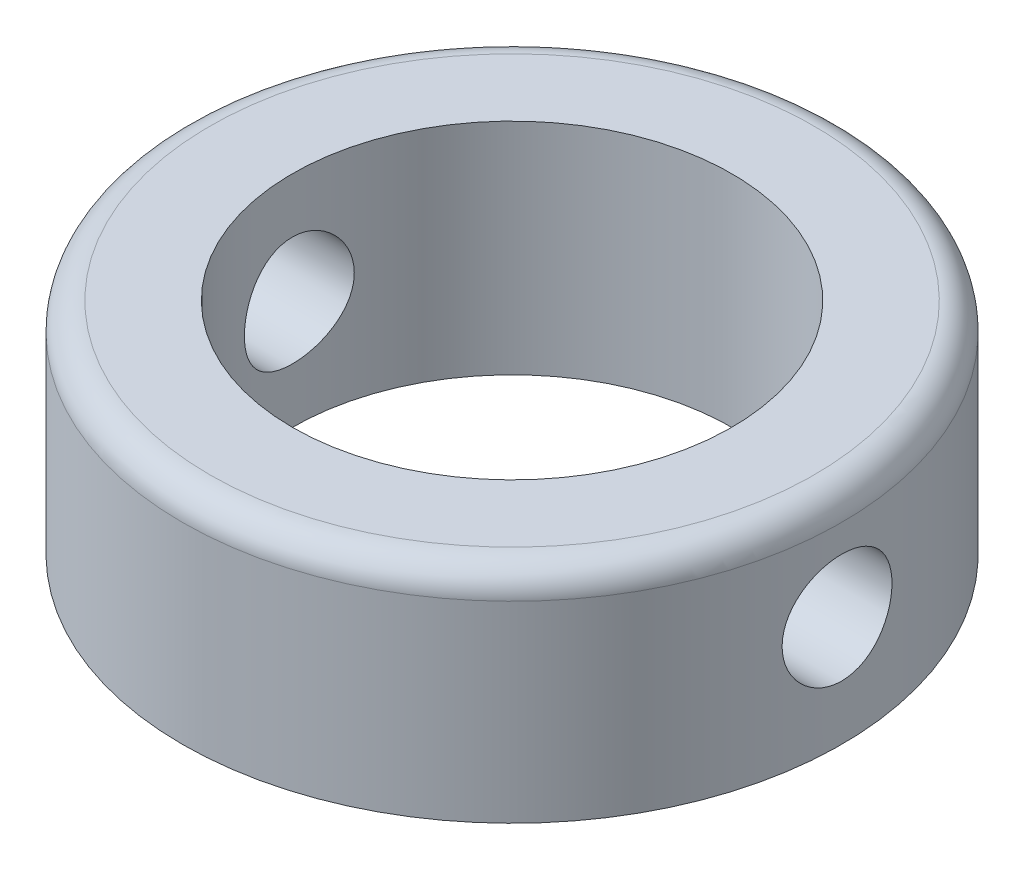
ISO-10303-21;
HEADER;
FILE_DESCRIPTION(('STEP AP214'),'2;1');
FILE_NAME('part.step','',(''),(''),'','','');
FILE_SCHEMA(('AUTOMOTIVE_DESIGN { 1 0 10303 214 1 1 1 1 }'));
ENDSEC;
DATA;
#1=APPLICATION_CONTEXT('core data for automotive mechanical design processes');
#2=APPLICATION_PROTOCOL_DEFINITION('international standard','automotive_design',2000,#1);
#3=PRODUCT_CONTEXT('',#1,'mechanical');
#4=PRODUCT('Part','Part','',(#3));
#5=PRODUCT_RELATED_PRODUCT_CATEGORY('part','',(#4));
#6=PRODUCT_DEFINITION_FORMATION('','',#4);
#7=PRODUCT_DEFINITION_CONTEXT('part definition',#1,'design');
#8=PRODUCT_DEFINITION('design','',#6,#7);
#9=PRODUCT_DEFINITION_SHAPE('','',#8);
#10=(LENGTH_UNIT() NAMED_UNIT(*) SI_UNIT(.MILLI.,.METRE.));
#11=(NAMED_UNIT(*) PLANE_ANGLE_UNIT() SI_UNIT($,.RADIAN.));
#12=(NAMED_UNIT(*) SI_UNIT($,.STERADIAN.) SOLID_ANGLE_UNIT());
#13=UNCERTAINTY_MEASURE_WITH_UNIT(LENGTH_MEASURE(1.E-05),#10,'distance_accuracy_value','');
#14=(GEOMETRIC_REPRESENTATION_CONTEXT(3) GLOBAL_UNCERTAINTY_ASSIGNED_CONTEXT((#13)) GLOBAL_UNIT_ASSIGNED_CONTEXT((#10,
#11,#12)) REPRESENTATION_CONTEXT('',''));
#15=CARTESIAN_POINT('',(0.,0.,0.));
#16=DIRECTION('',(0.,0.,1.));
#17=DIRECTION('',(1.,0.,0.));
#18=AXIS2_PLACEMENT_3D('',#15,#16,#17);
#19=CARTESIAN_POINT('',(0.,8.,0.));
#20=DIRECTION('',(0.,1.,0.));
#21=DIRECTION('',(0.,0.,1.));
#22=AXIS2_PLACEMENT_3D('',#19,#20,#21);
#23=PLANE('',#22);
#24=CARTESIAN_POINT('',(0.,8.,0.));
#25=DIRECTION('',(0.,1.,0.));
#26=DIRECTION('',(0.,0.,1.));
#27=AXIS2_PLACEMENT_3D('',#24,#25,#26);
#28=CIRCLE('',#27,11.);
#29=CARTESIAN_POINT('',(0.,8.,11.));
#30=VERTEX_POINT('',#29);
#31=EDGE_CURVE('E43',#30,#30,#28,.T.);
#32=ORIENTED_EDGE('',*,*,#31,.T.);
#33=EDGE_LOOP('',(#32));
#34=FACE_BOUND('',#33,.T.);
#35=CARTESIAN_POINT('',(0.,8.,0.));
#36=DIRECTION('',(0.,1.,0.));
#37=DIRECTION('',(0.,0.,1.));
#38=AXIS2_PLACEMENT_3D('',#35,#36,#37);
#39=CIRCLE('',#38,8.);
#40=CARTESIAN_POINT('',(0.,8.,8.));
#41=VERTEX_POINT('',#40);
#42=EDGE_CURVE('E93',#41,#41,#39,.T.);
#43=ORIENTED_EDGE('',*,*,#42,.F.);
#44=EDGE_LOOP('',(#43));
#45=FACE_BOUND('',#44,.T.);
#46=ADVANCED_FACE('F31',(#34,#45),#23,.T.);
#47=CARTESIAN_POINT('',(0.,0.,0.));
#48=DIRECTION('',(0.,1.,0.));
#49=DIRECTION('',(0.,0.,1.));
#50=AXIS2_PLACEMENT_3D('',#47,#48,#49);
#51=PLANE('',#50);
#52=CARTESIAN_POINT('',(0.,0.,0.));
#53=DIRECTION('',(0.,1.,0.));
#54=DIRECTION('',(0.,0.,1.));
#55=AXIS2_PLACEMENT_3D('',#52,#53,#54);
#56=CIRCLE('',#55,12.);
#57=CARTESIAN_POINT('',(0.,0.,12.));
#58=VERTEX_POINT('',#57);
#59=EDGE_CURVE('E48',#58,#58,#56,.T.);
#60=ORIENTED_EDGE('',*,*,#59,.F.);
#61=EDGE_LOOP('',(#60));
#62=FACE_BOUND('',#61,.T.);
#63=CARTESIAN_POINT('',(0.,0.,0.));
#64=DIRECTION('',(0.,1.,0.));
#65=DIRECTION('',(0.,0.,1.));
#66=AXIS2_PLACEMENT_3D('',#63,#64,#65);
#67=CIRCLE('',#66,8.);
#68=CARTESIAN_POINT('',(0.,0.,8.));
#69=VERTEX_POINT('',#68);
#70=EDGE_CURVE('E95',#69,#69,#67,.T.);
#71=ORIENTED_EDGE('',*,*,#70,.T.);
#72=EDGE_LOOP('',(#71));
#73=FACE_BOUND('',#72,.T.);
#74=ADVANCED_FACE('F80',(#62,#73),#51,.F.);
#75=CARTESIAN_POINT('',(0.,8.,0.));
#76=DIRECTION('',(0.,-1.,0.));
#77=DIRECTION('',(0.,0.,-1.));
#78=AXIS2_PLACEMENT_3D('',#75,#76,#77);
#79=CYLINDRICAL_SURFACE('',#78,12.);
#80=CARTESIAN_POINT('',(-11.8321595661992,4.,-2.));
#81=CARTESIAN_POINT('',(-11.8321615789328,4.11150059852945,-1.99999551873586));
#82=CARTESIAN_POINT('',(-11.8337527390819,4.22306208485718,-1.99064413522262));
#83=CARTESIAN_POINT('',(-11.8399396576003,4.44305483461054,-1.9535019424531));
#84=CARTESIAN_POINT('',(-11.844538186771,4.55148311500645,-1.92569412824689));
#85=CARTESIAN_POINT('',(-11.8562048749385,4.76199382667329,-1.8525036349364));
#86=CARTESIAN_POINT('',(-11.8632709694721,4.8640814789298,-1.80713564394559));
#87=CARTESIAN_POINT('',(-11.8790741768183,5.05918476377422,-1.70014919751157));
#88=CARTESIAN_POINT('',(-11.8878111015538,5.15220141566187,-1.63853257080106));
#89=CARTESIAN_POINT('',(-11.906067769247,5.32745027979565,-1.50015002157323));
#90=CARTESIAN_POINT('',(-11.9155937386236,5.40958010510897,-1.42325523914587));
#91=CARTESIAN_POINT('',(-11.9342998453486,5.55983464548945,-1.25677760375622));
#92=CARTESIAN_POINT('',(-11.9434799621739,5.62795853049233,-1.16719399931998));
#93=CARTESIAN_POINT('',(-11.9605258958617,5.74865165377542,-0.977218295958684));
#94=CARTESIAN_POINT('',(-11.9683835394587,5.80112560618544,-0.876764865165366));
#95=CARTESIAN_POINT('',(-11.9818298956567,5.88841685642444,-0.668316497379094));
#96=CARTESIAN_POINT('',(-11.9874187557813,5.9232353023079,-0.56032205126255));
#97=CARTESIAN_POINT('',(-11.9956538777952,5.97391402798712,-0.340914981075393));
#98=CARTESIAN_POINT('',(-11.9983268248873,5.98994633280375,-0.229543109343416));
#99=CARTESIAN_POINT('',(-12.0005206347422,6.00313260332208,-0.00566022842063707));
#100=CARTESIAN_POINT('',(-12.0000417117545,6.00028785219779,0.106850702823119));
#101=CARTESIAN_POINT('',(-11.9960068674511,5.97593491877743,0.328641748063101));
#102=CARTESIAN_POINT('',(-11.9924814695392,5.95461186927268,0.437942824560113));
#103=CARTESIAN_POINT('',(-11.9827838301731,5.89419914060281,0.651393583689433));
#104=CARTESIAN_POINT('',(-11.9766115081057,5.8551089203284,0.755543109321203));
#105=CARTESIAN_POINT('',(-11.9622615880957,5.76008748774775,0.956284918226118));
#106=CARTESIAN_POINT('',(-11.954074938615,5.70407999033405,1.05284041841524));
#107=CARTESIAN_POINT('',(-11.936605904572,5.57686974189196,1.23525242387731));
#108=CARTESIAN_POINT('',(-11.9273234313531,5.50566576103135,1.3211080623327));
#109=CARTESIAN_POINT('',(-11.9085621458608,5.34905695470455,1.48077701875733));
#110=CARTESIAN_POINT('',(-11.8990823178483,5.26349032407921,1.55443160180257));
#111=CARTESIAN_POINT('',(-11.8811036782784,5.08113032782734,1.68636367075845));
#112=CARTESIAN_POINT('',(-11.8726048757706,4.98433685865374,1.74464101482593));
#113=CARTESIAN_POINT('',(-11.8575500364945,4.78208668649802,1.84419554759063));
#114=CARTESIAN_POINT('',(-11.8509961864208,4.67662040152633,1.88545362182339));
#115=CARTESIAN_POINT('',(-11.840609509519,4.46012074215396,1.94962389665249));
#116=CARTESIAN_POINT('',(-11.8367764431066,4.34908785885406,1.97253771261436));
#117=CARTESIAN_POINT('',(-11.8323116753769,4.1260270750703,1.99914550790341));
#118=CARTESIAN_POINT('',(-11.8316422860693,4.01402689623832,2.00306576632995));
#119=CARTESIAN_POINT('',(-11.8334802782589,3.79097066264734,1.99217816214597));
#120=CARTESIAN_POINT('',(-11.8359875370548,3.67991457158882,1.97737102289973));
#121=CARTESIAN_POINT('',(-11.8438614996401,3.46261779264731,1.92964186794248));
#122=CARTESIAN_POINT('',(-11.8492100153468,3.35635108809759,1.89683503251711));
#123=CARTESIAN_POINT('',(-11.862148584044,3.15082386697641,1.81415855215382));
#124=CARTESIAN_POINT('',(-11.8697387711246,3.05156376995928,1.76428788648075));
#125=CARTESIAN_POINT('',(-11.8863930271791,2.86186032447511,1.64836533858338));
#126=CARTESIAN_POINT('',(-11.8954700448028,2.77150674179515,1.58216845132749));
#127=CARTESIAN_POINT('',(-11.9140373334389,2.603109173844,1.43567157256638));
#128=CARTESIAN_POINT('',(-11.9235276334826,2.52506605511221,1.35537058910724));
#129=CARTESIAN_POINT('',(-11.9419713769461,2.38267848581704,1.18194245626305));
#130=CARTESIAN_POINT('',(-11.9509182107574,2.31848493897237,1.08869060270896));
#131=CARTESIAN_POINT('',(-11.9671608994635,2.2066757383961,0.892594758359461));
#132=CARTESIAN_POINT('',(-11.9744568077598,2.15905954842092,0.789751077976501));
#133=CARTESIAN_POINT('',(-11.9865468653567,2.08199153283611,0.577839241201062));
#134=CARTESIAN_POINT('',(-11.9913518765409,2.05246073941206,0.468800450082089));
#135=CARTESIAN_POINT('',(-11.9979646653543,2.01214752082894,0.247224587899369));
#136=CARTESIAN_POINT('',(-11.9997726896015,2.00136355301412,0.134687805457296));
#137=CARTESIAN_POINT('',(-12.0001843031025,1.99889449415024,-0.0892330206189419));
#138=CARTESIAN_POINT('',(-11.9988264161935,2.00697979684713,-0.200614528482133));
#139=CARTESIAN_POINT('',(-11.9931374270986,2.04152313781554,-0.420409579451765));
#140=CARTESIAN_POINT('',(-11.9888063415615,2.06798107320774,-0.528823139173984));
#141=CARTESIAN_POINT('',(-11.9776559106192,2.13843053243492,-0.739517156734829));
#142=CARTESIAN_POINT('',(-11.970839336327,2.18240253456804,-0.841804297723055));
#143=CARTESIAN_POINT('',(-11.9554620550242,2.28660634898446,-1.03758436238573));
#144=CARTESIAN_POINT('',(-11.9469012653393,2.34683893204996,-1.13107686889458));
#145=CARTESIAN_POINT('',(-11.9288610369313,2.4826680739684,-1.30777035642112));
#146=CARTESIAN_POINT('',(-11.919372196329,2.558432763801,-1.3908411444822));
#147=CARTESIAN_POINT('',(-11.9006104265149,2.72282264632305,-1.54317110076073));
#148=CARTESIAN_POINT('',(-11.8913375483961,2.81145084713002,-1.61242702936952));
#149=CARTESIAN_POINT('',(-11.8739867482713,2.99979625799169,-1.73561141672869));
#150=CARTESIAN_POINT('',(-11.8659177427663,3.09958747181239,-1.78942799124616));
#151=CARTESIAN_POINT('',(-11.8519936807305,3.30688738867052,-1.87945162912342));
#152=CARTESIAN_POINT('',(-11.846136413799,3.41438825814189,-1.91567628417846));
#153=CARTESIAN_POINT('',(-11.8385979588519,3.60192301558991,-1.96162084250194));
#154=CARTESIAN_POINT('',(-11.8361969873557,3.68082144637008,-1.97598993413711));
#155=CARTESIAN_POINT('',(-11.8329770823046,3.83980278786955,-1.99518103614505));
#156=CARTESIAN_POINT('',(-11.8321581200295,3.91988567705936,-2.00000321983422));
#157=CARTESIAN_POINT('',(-11.8321595661992,4.,-2.));
#158=B_SPLINE_CURVE_WITH_KNOTS('',3,(#80,#81,#82,#83,#84,#85,#86,#87,#88,#89,#90,#91,#92,#93,
#94,#95,#96,#97,#98,#99,#100,#101,#102,#103,#104,#105,#106,#107,#108,#109,#110,#111,#112,#113,
#114,#115,#116,#117,#118,#119,#120,#121,#122,#123,#124,#125,#126,#127,#128,#129,#130,#131,#132,
#133,#134,#135,#136,#137,#138,#139,#140,#141,#142,#143,#144,#145,#146,#147,#148,#149,#150,#151,
#152,#153,#154,#155,#156,#157),.UNSPECIFIED.,.T.,.F.,(4,2,2,2,2,2,2,2,2,2,2,2,2,2,2,2,2,2,2,2,2,
2,2,2,2,2,2,2,2,2,2,2,2,2,2,2,2,2,4),(0.,0.334208831142192,0.668726015970376,1.00296399830015,
1.33716437924219,1.67431327324572,2.01148214267558,2.35066384089148,2.6898234808889,
3.02585253978052,3.36185875722154,3.69453696931735,4.02722531399626,4.3614368331154,
4.69567540981411,5.03396898769699,5.37226568596815,5.71094129998883,6.04958708750462,
6.38418833936328,6.71877666731181,7.05124851708393,7.38374025834859,7.71929874210161,
8.05488083544551,8.39395290428305,8.73301400381358,9.07058387534117,9.40812596729881,
9.74158221012733,10.0750365857506,10.4081203186597,10.7412198431387,11.078135979706,
11.4151310310545,11.7545098209466,12.0935485339556,12.3336853643501,12.5738178352145),.UNSPECIFIED.);
#159=CARTESIAN_POINT('',(-11.8321595661992,4.,-2.));
#160=VERTEX_POINT('',#159);
#161=EDGE_CURVE('E72',#160,#160,#158,.T.);
#162=ORIENTED_EDGE('',*,*,#161,.T.);
#163=EDGE_LOOP('',(#162));
#164=FACE_BOUND('',#163,.T.);
#165=CARTESIAN_POINT('',(11.8321595661992,4.,-2.));
#166=CARTESIAN_POINT('',(11.8321615789328,3.88849940147055,-1.99999551873586));
#167=CARTESIAN_POINT('',(11.8337527390819,3.77693791514282,-1.99064413522263));
#168=CARTESIAN_POINT('',(11.8399396576003,3.55694516538947,-1.9535019424531));
#169=CARTESIAN_POINT('',(11.844538186771,3.44851688499355,-1.92569412824689));
#170=CARTESIAN_POINT('',(11.8562048749385,3.23800617332672,-1.8525036349364));
#171=CARTESIAN_POINT('',(11.8632709694721,3.1359185210702,-1.80713564394559));
#172=CARTESIAN_POINT('',(11.8790741768183,2.94081523622578,-1.70014919751157));
#173=CARTESIAN_POINT('',(11.8878111015538,2.84779858433814,-1.63853257080106));
#174=CARTESIAN_POINT('',(11.906067769247,2.67254972020435,-1.50015002157323));
#175=CARTESIAN_POINT('',(11.9155937386236,2.59041989489103,-1.42325523914587));
#176=CARTESIAN_POINT('',(11.9342998453486,2.44016535451055,-1.25677760375622));
#177=CARTESIAN_POINT('',(11.9434799621739,2.37204146950767,-1.16719399931998));
#178=CARTESIAN_POINT('',(11.9605258958617,2.25134834622458,-0.977218295958686));
#179=CARTESIAN_POINT('',(11.9683835394587,2.19887439381456,-0.876764865165368));
#180=CARTESIAN_POINT('',(11.9818298956567,2.11158314357556,-0.668316497379096));
#181=CARTESIAN_POINT('',(11.9874187557813,2.0767646976921,-0.560322051262552));
#182=CARTESIAN_POINT('',(11.9956538777952,2.02608597201288,-0.340914981075395));
#183=CARTESIAN_POINT('',(11.9983268248873,2.01005366719625,-0.229543109343418));
#184=CARTESIAN_POINT('',(12.0005206347422,1.99686739667792,-0.00566022842063849));
#185=CARTESIAN_POINT('',(12.0000417117545,1.99971214780221,0.106850702823118));
#186=CARTESIAN_POINT('',(11.9960068674511,2.02406508122257,0.3286417480631));
#187=CARTESIAN_POINT('',(11.9924814695392,2.04538813072732,0.437942824560112));
#188=CARTESIAN_POINT('',(11.9827838301731,2.10580085939719,0.651393583689433));
#189=CARTESIAN_POINT('',(11.9766115081057,2.1448910796716,0.755543109321203));
#190=CARTESIAN_POINT('',(11.9622615880957,2.23991251225226,0.956284918226118));
#191=CARTESIAN_POINT('',(11.954074938615,2.29592000966595,1.05284041841524));
#192=CARTESIAN_POINT('',(11.936605904572,2.42313025810804,1.23525242387731));
#193=CARTESIAN_POINT('',(11.9273234313531,2.49433423896865,1.3211080623327));
#194=CARTESIAN_POINT('',(11.9085621458608,2.65094304529545,1.48077701875733));
#195=CARTESIAN_POINT('',(11.8990823178483,2.73650967592079,1.55443160180257));
#196=CARTESIAN_POINT('',(11.8811036782784,2.91886967217266,1.68636367075845));
#197=CARTESIAN_POINT('',(11.8726048757706,3.01566314134626,1.74464101482593));
#198=CARTESIAN_POINT('',(11.8575500364945,3.21791331350198,1.84419554759063));
#199=CARTESIAN_POINT('',(11.8509961864208,3.32337959847367,1.88545362182339));
#200=CARTESIAN_POINT('',(11.840609509519,3.53987925784604,1.94962389665249));
#201=CARTESIAN_POINT('',(11.8367764431066,3.65091214114594,1.97253771261436));
#202=CARTESIAN_POINT('',(11.8323116753769,3.87397292492971,1.99914550790341));
#203=CARTESIAN_POINT('',(11.8316422860693,3.98597310376168,2.00306576632995));
#204=CARTESIAN_POINT('',(11.8334802782589,4.20902933735266,1.99217816214597));
#205=CARTESIAN_POINT('',(11.8359875370548,4.32008542841118,1.97737102289973));
#206=CARTESIAN_POINT('',(11.8438614996401,4.53738220735269,1.92964186794248));
#207=CARTESIAN_POINT('',(11.8492100153468,4.64364891190241,1.89683503251711));
#208=CARTESIAN_POINT('',(11.862148584044,4.84917613302359,1.81415855215382));
#209=CARTESIAN_POINT('',(11.8697387711246,4.94843623004072,1.76428788648075));
#210=CARTESIAN_POINT('',(11.8863930271791,5.13813967552489,1.64836533858338));
#211=CARTESIAN_POINT('',(11.8954700448028,5.22849325820485,1.58216845132749));
#212=CARTESIAN_POINT('',(11.9140373334389,5.396890826156,1.43567157256639));
#213=CARTESIAN_POINT('',(11.9235276334826,5.47493394488779,1.35537058910724));
#214=CARTESIAN_POINT('',(11.9419713769461,5.61732151418296,1.18194245626305));
#215=CARTESIAN_POINT('',(11.9509182107574,5.68151506102763,1.08869060270896));
#216=CARTESIAN_POINT('',(11.9671608994635,5.7933242616039,0.892594758359463));
#217=CARTESIAN_POINT('',(11.9744568077598,5.84094045157908,0.789751077976503));
#218=CARTESIAN_POINT('',(11.9865468653567,5.91800846716389,0.577839241201064));
#219=CARTESIAN_POINT('',(11.9913518765409,5.94753926058794,0.468800450082091));
#220=CARTESIAN_POINT('',(11.9979646653543,5.98785247917106,0.24722458789937));
#221=CARTESIAN_POINT('',(11.9997726896015,5.99863644698588,0.134687805457298));
#222=CARTESIAN_POINT('',(12.0001843031025,6.00110550584976,-0.0892330206189402));
#223=CARTESIAN_POINT('',(11.9988264161935,5.99302020315287,-0.200614528482131));
#224=CARTESIAN_POINT('',(11.9931374270986,5.95847686218446,-0.420409579451763));
#225=CARTESIAN_POINT('',(11.9888063415615,5.93201892679226,-0.528823139173983));
#226=CARTESIAN_POINT('',(11.9776559106192,5.86156946756508,-0.73951715673483));
#227=CARTESIAN_POINT('',(11.970839336327,5.81759746543196,-0.841804297723056));
#228=CARTESIAN_POINT('',(11.9554620550242,5.71339365101554,-1.03758436238573));
#229=CARTESIAN_POINT('',(11.9469012653393,5.65316106795004,-1.13107686889458));
#230=CARTESIAN_POINT('',(11.9288610369313,5.5173319260316,-1.30777035642112));
#231=CARTESIAN_POINT('',(11.919372196329,5.44156723619899,-1.3908411444822));
#232=CARTESIAN_POINT('',(11.9006104265149,5.27717735367695,-1.54317110076073));
#233=CARTESIAN_POINT('',(11.8913375483961,5.18854915286998,-1.61242702936952));
#234=CARTESIAN_POINT('',(11.8739867482713,5.00020374200831,-1.73561141672869));
#235=CARTESIAN_POINT('',(11.8659177427663,4.90041252818761,-1.78942799124616));
#236=CARTESIAN_POINT('',(11.8519936807305,4.69311261132948,-1.87945162912342));
#237=CARTESIAN_POINT('',(11.846136413799,4.58561174185811,-1.91567628417846));
#238=CARTESIAN_POINT('',(11.8385979588519,4.39807698441009,-1.96162084250194));
#239=CARTESIAN_POINT('',(11.8361969873557,4.31917855362991,-1.97598993413711));
#240=CARTESIAN_POINT('',(11.8329770823046,4.16019721213045,-1.99518103614505));
#241=CARTESIAN_POINT('',(11.8321581200295,4.08011432294064,-2.00000321983422));
#242=CARTESIAN_POINT('',(11.8321595661992,4.,-2.));
#243=B_SPLINE_CURVE_WITH_KNOTS('',3,(#165,#166,#167,#168,#169,#170,#171,#172,#173,#174,#175,
#176,#177,#178,#179,#180,#181,#182,#183,#184,#185,#186,#187,#188,#189,#190,#191,#192,#193,#194,
#195,#196,#197,#198,#199,#200,#201,#202,#203,#204,#205,#206,#207,#208,#209,#210,#211,#212,#213,
#214,#215,#216,#217,#218,#219,#220,#221,#222,#223,#224,#225,#226,#227,#228,#229,#230,#231,#232,
#233,#234,#235,#236,#237,#238,#239,#240,#241,#242),.UNSPECIFIED.,.T.,.F.,(4,2,2,2,2,2,2,2,2,2,2,
2,2,2,2,2,2,2,2,2,2,2,2,2,2,2,2,2,2,2,2,2,2,2,2,2,2,2,4),(0.,0.334208831142192,
0.668726015970375,1.00296399830015,1.33716437924219,1.67431327324572,2.01148214267557,
2.35066384089148,2.6898234808889,3.02585253978052,3.36185875722153,3.69453696931735,
4.02722531399626,4.3614368331154,4.69567540981411,5.03396898769699,5.37226568596815,
5.71094129998883,6.04958708750461,6.38418833936328,6.71877666731181,7.05124851708393,
7.38374025834859,7.71929874210161,8.05488083544551,8.39395290428305,8.73301400381358,
9.07058387534117,9.4081259672988,9.74158221012733,10.0750365857506,10.4081203186597,
10.7412198431387,11.078135979706,11.4151310310545,11.7545098209466,12.0935485339556,
12.3336853643501,12.5738178352145),.UNSPECIFIED.);
#244=CARTESIAN_POINT('',(11.8321595661992,4.,-2.));
#245=VERTEX_POINT('',#244);
#246=EDGE_CURVE('E68',#245,#245,#243,.T.);
#247=ORIENTED_EDGE('',*,*,#246,.T.);
#248=EDGE_LOOP('',(#247));
#249=FACE_BOUND('',#248,.T.);
#250=CARTESIAN_POINT('',(0.,7.,0.));
#251=DIRECTION('',(0.,1.,0.));
#252=DIRECTION('',(0.,0.,1.));
#253=AXIS2_PLACEMENT_3D('',#250,#251,#252);
#254=CIRCLE('',#253,12.);
#255=CARTESIAN_POINT('',(0.,7.,12.));
#256=VERTEX_POINT('',#255);
#257=EDGE_CURVE('E10',#256,#256,#254,.F.);
#258=ORIENTED_EDGE('',*,*,#257,.T.);
#259=EDGE_LOOP('',(#258));
#260=FACE_BOUND('',#259,.T.);
#261=ORIENTED_EDGE('',*,*,#59,.T.);
#262=EDGE_LOOP('',(#261));
#263=FACE_BOUND('',#262,.T.);
#264=ADVANCED_FACE('F76',(#164,#249,#260,#263),#79,.T.);
#265=CARTESIAN_POINT('',(0.,8.,0.));
#266=DIRECTION('',(0.,-1.,0.));
#267=DIRECTION('',(0.,0.,-1.));
#268=AXIS2_PLACEMENT_3D('',#265,#266,#267);
#269=CYLINDRICAL_SURFACE('',#268,8.);
#270=CARTESIAN_POINT('',(-7.74596669241483,4.,-2.));
#271=CARTESIAN_POINT('',(-7.74596880070288,4.11044060074126,-1.99999686287446));
#272=CARTESIAN_POINT('',(-7.74835444811678,4.22091591894282,-1.99082099639812));
#273=CARTESIAN_POINT('',(-7.75761489594051,4.43869406253881,-1.95441850037103));
#274=CARTESIAN_POINT('',(-7.76449230897304,4.54599500357455,-1.92718136539368));
#275=CARTESIAN_POINT('',(-7.7819097967692,4.75424283054975,-1.85559295970563));
#276=CARTESIAN_POINT('',(-7.79244514152366,4.85519772430856,-1.81126378228359));
#277=CARTESIAN_POINT('',(-7.81598553623007,5.0482486820319,-1.70681691300911));
#278=CARTESIAN_POINT('',(-7.82899069102791,5.14034436966417,-1.64669855084855));
#279=CARTESIAN_POINT('',(-7.856325730845,5.31508931620977,-1.51096674184951));
#280=CARTESIAN_POINT('',(-7.87067678098427,5.39751488028004,-1.43506951016324));
#281=CARTESIAN_POINT('',(-7.89890300412235,5.54860911548827,-1.27054565128053));
#282=CARTESIAN_POINT('',(-7.91277813253111,5.6172765004974,-1.18191783534424));
#283=CARTESIAN_POINT('',(-7.93872332416466,5.73982037410502,-0.992916160863163));
#284=CARTESIAN_POINT('',(-7.95076549920474,5.79347711052917,-0.892395660956096));
#285=CARTESIAN_POINT('',(-7.97144649540787,5.88304771532247,-0.683410547434209));
#286=CARTESIAN_POINT('',(-7.98008581867475,5.91896420153241,-0.574947108633552));
#287=CARTESIAN_POINT('',(-7.99283807078544,5.97131826766287,-0.355487007003329));
#288=CARTESIAN_POINT('',(-7.99703915075451,5.98813571546127,-0.24458617563918));
#289=CARTESIAN_POINT('',(-8.00074875285838,6.00300670342044,-0.0214630554102152));
#290=CARTESIAN_POINT('',(-8.00025796877363,6.00106301776768,0.090759035630455));
#291=CARTESIAN_POINT('',(-7.99470475962828,5.97874011979988,0.310704494344774));
#292=CARTESIAN_POINT('',(-7.98974401872699,5.95877093995692,0.418472431202134));
#293=CARTESIAN_POINT('',(-7.97592669219883,5.9016229839612,0.629076494827372));
#294=CARTESIAN_POINT('',(-7.96706989918753,5.86444329169807,0.731912358740875));
#295=CARTESIAN_POINT('',(-7.94630007760717,5.77359794345035,0.930813407003612));
#296=CARTESIAN_POINT('',(-7.93436015756043,5.7197863642706,1.02680901953301));
#297=CARTESIAN_POINT('',(-7.90871923047719,5.59731545670699,1.20855124468098));
#298=CARTESIAN_POINT('',(-7.89501791721992,5.52865354515151,1.29429607017101));
#299=CARTESIAN_POINT('',(-7.86690971015616,5.3762330064141,1.45554807016991));
#300=CARTESIAN_POINT('',(-7.85249375620734,5.29211608612178,1.5307153581504));
#301=CARTESIAN_POINT('',(-7.82492034813365,5.1123200211678,1.66595275192604));
#302=CARTESIAN_POINT('',(-7.81176295284776,5.0166403364072,1.72602215209203));
#303=CARTESIAN_POINT('',(-7.78816397465319,4.81576797268083,1.82957625804519));
#304=CARTESIAN_POINT('',(-7.77773586980577,4.71053141574945,1.87297913394098));
#305=CARTESIAN_POINT('',(-7.76094912111966,4.49393162553884,1.94137124127268));
#306=CARTESIAN_POINT('',(-7.75458960648175,4.38256970881349,1.96636441310582));
#307=CARTESIAN_POINT('',(-7.74684284831313,4.16003239878151,1.99666371093214));
#308=CARTESIAN_POINT('',(-7.74532871274919,4.0489297653363,2.0024723791357));
#309=CARTESIAN_POINT('',(-7.74709874784831,3.82734245073748,1.99561359241244));
#310=CARTESIAN_POINT('',(-7.75038247681013,3.71685771363901,1.98294783827904));
#311=CARTESIAN_POINT('',(-7.76125665563648,3.50150858803624,1.93994037115013));
#312=CARTESIAN_POINT('',(-7.768775761875,3.39658181874333,1.9098912546254));
#313=CARTESIAN_POINT('',(-7.7872057461677,3.19325483371866,1.8332944653365));
#314=CARTESIAN_POINT('',(-7.79811702598891,3.09485539275573,1.78674483817004));
#315=CARTESIAN_POINT('',(-7.8223690967461,2.90524697770612,1.67741653434925));
#316=CARTESIAN_POINT('',(-7.83575334885313,2.81421692796552,1.6143374030685));
#317=CARTESIAN_POINT('',(-7.86333666457373,2.64384930975892,1.47412058586891));
#318=CARTESIAN_POINT('',(-7.87753586182776,2.56451366667994,1.39698058961088));
#319=CARTESIAN_POINT('',(-7.90557922425285,2.41775116594324,1.22852544196945));
#320=CARTESIAN_POINT('',(-7.91940561649468,2.35067194996095,1.13690390506319));
#321=CARTESIAN_POINT('',(-7.94477773290987,2.23285130643901,0.943405365389351));
#322=CARTESIAN_POINT('',(-7.95632357603169,2.18210902671344,0.841528897915182));
#323=CARTESIAN_POINT('',(-7.9757609259065,2.09884317237765,0.631116403462182));
#324=CARTESIAN_POINT('',(-7.98367864017925,2.06618857249675,0.522634762055765));
#325=CARTESIAN_POINT('',(-7.99508234716634,2.01963173231327,0.301499520637615));
#326=CARTESIAN_POINT('',(-7.99856919514738,2.00572587300877,0.188846730082482));
#327=CARTESIAN_POINT('',(-8.00068338817612,1.99726482084892,-0.034167052886645));
#328=CARTESIAN_POINT('',(-7.99943957759977,2.00219658180918,-0.144507653932042));
#329=CARTESIAN_POINT('',(-7.99251792914887,2.0300956545887,-0.3627349928295));
#330=CARTESIAN_POINT('',(-7.98684022314338,2.05306243002634,-0.470621803561855));
#331=CARTESIAN_POINT('',(-7.97170865707778,2.11610443954172,-0.680342071289546));
#332=CARTESIAN_POINT('',(-7.96227529004785,2.15608690662876,-0.782204989161724));
#333=CARTESIAN_POINT('',(-7.94062577827316,2.25194115803914,-0.977834106083247));
#334=CARTESIAN_POINT('',(-7.92840928277515,2.30781494534097,-1.07159928253126));
#335=CARTESIAN_POINT('',(-7.90214499360574,2.43543046799226,-1.25080385684661));
#336=CARTESIAN_POINT('',(-7.88806033883329,2.50752028580766,-1.33598997659667));
#337=CARTESIAN_POINT('',(-7.85981298114379,2.66484570395469,-1.49323004054701));
#338=CARTESIAN_POINT('',(-7.84565025934604,2.75008463222232,-1.56528065015318));
#339=CARTESIAN_POINT('',(-7.81854951691005,2.93320282837892,-1.69552405294366));
#340=CARTESIAN_POINT('',(-7.80563927346578,3.03128824673051,-1.75343323883276));
#341=CARTESIAN_POINT('',(-7.78287910989656,3.23611097974964,-1.85185379317094));
#342=CARTESIAN_POINT('',(-7.77302696466427,3.34284193218769,-1.8923778195043));
#343=CARTESIAN_POINT('',(-7.75903817501475,3.54115402367032,-1.948845057142));
#344=CARTESIAN_POINT('',(-7.75417326006998,3.63178632877227,-1.96798634119376));
#345=CARTESIAN_POINT('',(-7.7476367716524,3.81493773799538,-1.99356458514354));
#346=CARTESIAN_POINT('',(-7.74596492578215,3.9074566804888,-2.0000026287435));
#347=CARTESIAN_POINT('',(-7.74596669241483,4.,-2.));
#348=B_SPLINE_CURVE_WITH_KNOTS('',3,(#270,#271,#272,#273,#274,#275,#276,#277,#278,#279,#280,
#281,#282,#283,#284,#285,#286,#287,#288,#289,#290,#291,#292,#293,#294,#295,#296,#297,#298,#299,
#300,#301,#302,#303,#304,#305,#306,#307,#308,#309,#310,#311,#312,#313,#314,#315,#316,#317,#318,
#319,#320,#321,#322,#323,#324,#325,#326,#327,#328,#329,#330,#331,#332,#333,#334,#335,#336,#337,
#338,#339,#340,#341,#342,#343,#344,#345,#346,#347),.UNSPECIFIED.,.T.,.F.,(4,2,2,2,2,2,2,2,2,2,2,
2,2,2,2,2,2,2,2,2,2,2,2,2,2,2,2,2,2,2,2,2,2,2,2,2,2,2,4),(0.,0.330981953388909,
0.662156593142933,0.992904581732815,1.32366661404383,1.66099163354381,1.99834817183893,
2.34041197118336,2.68242527877674,3.01751000796277,3.35254518932816,3.68014610151157,
4.00776445379829,4.33834299403555,4.6689790837513,5.00856373257529,5.34816424959841,
5.68941145606722,6.03058560103638,6.36274859809373,6.69488101747041,7.02157924007365,
7.34831617137134,7.68146276687326,8.01466415108036,8.35620264772255,8.69772332575642,
9.03673658245543,9.3756843912723,9.70546756901965,10.0352409390158,10.3632390124777,
10.6912784459046,11.0271767726566,11.3631602525241,11.7054118182895,12.0474137709606,
12.3247826174462,12.6021278008238),.UNSPECIFIED.);
#349=CARTESIAN_POINT('',(-7.74596669241483,4.,-2.));
#350=VERTEX_POINT('',#349);
#351=EDGE_CURVE('E35',#350,#350,#348,.T.);
#352=ORIENTED_EDGE('',*,*,#351,.F.);
#353=EDGE_LOOP('',(#352));
#354=FACE_BOUND('',#353,.T.);
#355=CARTESIAN_POINT('',(7.74596669241483,4.,-2.));
#356=CARTESIAN_POINT('',(7.74596880070288,3.88955939925874,-1.99999686287446));
#357=CARTESIAN_POINT('',(7.74835444811678,3.77908408105718,-1.99082099639812));
#358=CARTESIAN_POINT('',(7.75761489594051,3.56130593746119,-1.95441850037103));
#359=CARTESIAN_POINT('',(7.76449230897304,3.45400499642545,-1.92718136539368));
#360=CARTESIAN_POINT('',(7.7819097967692,3.24575716945026,-1.85559295970563));
#361=CARTESIAN_POINT('',(7.79244514152366,3.14480227569143,-1.81126378228359));
#362=CARTESIAN_POINT('',(7.81598553623007,2.9517513179681,-1.70681691300911));
#363=CARTESIAN_POINT('',(7.82899069102791,2.85965563033583,-1.64669855084855));
#364=CARTESIAN_POINT('',(7.856325730845,2.68491068379023,-1.51096674184951));
#365=CARTESIAN_POINT('',(7.87067678098427,2.60248511971996,-1.43506951016324));
#366=CARTESIAN_POINT('',(7.89890300412235,2.45139088451173,-1.27054565128053));
#367=CARTESIAN_POINT('',(7.91277813253111,2.3827234995026,-1.18191783534425));
#368=CARTESIAN_POINT('',(7.93872332416466,2.26017962589498,-0.992916160863166));
#369=CARTESIAN_POINT('',(7.95076549920474,2.20652288947083,-0.892395660956099));
#370=CARTESIAN_POINT('',(7.97144649540787,2.11695228467753,-0.683410547434212));
#371=CARTESIAN_POINT('',(7.98008581867475,2.08103579846759,-0.574947108633555));
#372=CARTESIAN_POINT('',(7.99283807078544,2.02868173233713,-0.355487007003331));
#373=CARTESIAN_POINT('',(7.99703915075451,2.01186428453873,-0.244586175639182));
#374=CARTESIAN_POINT('',(8.00074875285838,1.99699329657956,-0.0214630554102174));
#375=CARTESIAN_POINT('',(8.00025796877363,1.99893698223232,0.090759035630453));
#376=CARTESIAN_POINT('',(7.99470475962828,2.02125988020012,0.310704494344773));
#377=CARTESIAN_POINT('',(7.98974401872699,2.04122906004309,0.418472431202132));
#378=CARTESIAN_POINT('',(7.97592669219883,2.0983770160388,0.629076494827371));
#379=CARTESIAN_POINT('',(7.96706989918753,2.13555670830193,0.731912358740875));
#380=CARTESIAN_POINT('',(7.94630007760717,2.22640205654965,0.930813407003612));
#381=CARTESIAN_POINT('',(7.93436015756043,2.2802136357294,1.02680901953301));
#382=CARTESIAN_POINT('',(7.90871923047719,2.40268454329301,1.20855124468098));
#383=CARTESIAN_POINT('',(7.89501791721992,2.4713464548485,1.29429607017101));
#384=CARTESIAN_POINT('',(7.86690971015616,2.6237669935859,1.45554807016991));
#385=CARTESIAN_POINT('',(7.85249375620734,2.70788391387822,1.5307153581504));
#386=CARTESIAN_POINT('',(7.82492034813365,2.8876799788322,1.66595275192604));
#387=CARTESIAN_POINT('',(7.81176295284776,2.9833596635928,1.72602215209203));
#388=CARTESIAN_POINT('',(7.78816397465319,3.18423202731917,1.8295762580452));
#389=CARTESIAN_POINT('',(7.77773586980577,3.28946858425056,1.87297913394098));
#390=CARTESIAN_POINT('',(7.76094912111966,3.50606837446116,1.94137124127268));
#391=CARTESIAN_POINT('',(7.75458960648175,3.61743029118651,1.96636441310582));
#392=CARTESIAN_POINT('',(7.74684284831313,3.8399676012185,1.99666371093214));
#393=CARTESIAN_POINT('',(7.74532871274919,3.9510702346637,2.0024723791357));
#394=CARTESIAN_POINT('',(7.74709874784831,4.17265754926253,1.99561359241244));
#395=CARTESIAN_POINT('',(7.75038247681013,4.28314228636099,1.98294783827904));
#396=CARTESIAN_POINT('',(7.76125665563648,4.49849141196376,1.93994037115013));
#397=CARTESIAN_POINT('',(7.768775761875,4.60341818125667,1.9098912546254));
#398=CARTESIAN_POINT('',(7.7872057461677,4.80674516628134,1.8332944653365));
#399=CARTESIAN_POINT('',(7.79811702598891,4.90514460724427,1.78674483817004));
#400=CARTESIAN_POINT('',(7.8223690967461,5.09475302229388,1.67741653434925));
#401=CARTESIAN_POINT('',(7.83575334885313,5.18578307203448,1.6143374030685));
#402=CARTESIAN_POINT('',(7.86333666457373,5.35615069024108,1.47412058586891));
#403=CARTESIAN_POINT('',(7.87753586182776,5.43548633332006,1.39698058961088));
#404=CARTESIAN_POINT('',(7.90557922425285,5.58224883405676,1.22852544196945));
#405=CARTESIAN_POINT('',(7.91940561649468,5.64932805003905,1.13690390506319));
#406=CARTESIAN_POINT('',(7.94477773290987,5.76714869356099,0.943405365389354));
#407=CARTESIAN_POINT('',(7.95632357603169,5.81789097328656,0.841528897915185));
#408=CARTESIAN_POINT('',(7.9757609259065,5.90115682762235,0.631116403462184));
#409=CARTESIAN_POINT('',(7.98367864017925,5.93381142750325,0.522634762055768));
#410=CARTESIAN_POINT('',(7.99508234716634,5.98036826768673,0.301499520637617));
#411=CARTESIAN_POINT('',(7.99856919514738,5.99427412699123,0.188846730082484));
#412=CARTESIAN_POINT('',(8.00068338817612,6.00273517915108,-0.0341670528866436));
#413=CARTESIAN_POINT('',(7.99943957759977,5.99780341819082,-0.144507653932041));
#414=CARTESIAN_POINT('',(7.99251792914887,5.9699043454113,-0.362734992829499));
#415=CARTESIAN_POINT('',(7.98684022314338,5.94693756997366,-0.470621803561855));
#416=CARTESIAN_POINT('',(7.97170865707778,5.88389556045828,-0.680342071289546));
#417=CARTESIAN_POINT('',(7.96227529004785,5.84391309337124,-0.782204989161724));
#418=CARTESIAN_POINT('',(7.94062577827316,5.74805884196086,-0.977834106083247));
#419=CARTESIAN_POINT('',(7.92840928277515,5.69218505465903,-1.07159928253127));
#420=CARTESIAN_POINT('',(7.90214499360574,5.56456953200773,-1.25080385684661));
#421=CARTESIAN_POINT('',(7.88806033883329,5.49247971419234,-1.33598997659667));
#422=CARTESIAN_POINT('',(7.85981298114379,5.33515429604531,-1.49323004054701));
#423=CARTESIAN_POINT('',(7.84565025934604,5.24991536777767,-1.56528065015318));
#424=CARTESIAN_POINT('',(7.81854951691005,5.06679717162108,-1.69552405294366));
#425=CARTESIAN_POINT('',(7.80563927346578,4.96871175326949,-1.75343323883276));
#426=CARTESIAN_POINT('',(7.78287910989656,4.76388902025036,-1.85185379317094));
#427=CARTESIAN_POINT('',(7.77302696466428,4.65715806781231,-1.8923778195043));
#428=CARTESIAN_POINT('',(7.75903817501475,4.45884597632968,-1.94884505714201));
#429=CARTESIAN_POINT('',(7.75417326006998,4.36821367122773,-1.96798634119376));
#430=CARTESIAN_POINT('',(7.7476367716524,4.18506226200462,-1.99356458514354));
#431=CARTESIAN_POINT('',(7.74596492578215,4.0925433195112,-2.0000026287435));
#432=CARTESIAN_POINT('',(7.74596669241483,4.,-2.));
#433=B_SPLINE_CURVE_WITH_KNOTS('',3,(#355,#356,#357,#358,#359,#360,#361,#362,#363,#364,#365,
#366,#367,#368,#369,#370,#371,#372,#373,#374,#375,#376,#377,#378,#379,#380,#381,#382,#383,#384,
#385,#386,#387,#388,#389,#390,#391,#392,#393,#394,#395,#396,#397,#398,#399,#400,#401,#402,#403,
#404,#405,#406,#407,#408,#409,#410,#411,#412,#413,#414,#415,#416,#417,#418,#419,#420,#421,#422,
#423,#424,#425,#426,#427,#428,#429,#430,#431,#432),.UNSPECIFIED.,.T.,.F.,(4,2,2,2,2,2,2,2,2,2,2,
2,2,2,2,2,2,2,2,2,2,2,2,2,2,2,2,2,2,2,2,2,2,2,2,2,2,2,4),(0.,0.330981953388908,
0.662156593142932,0.992904581732815,1.32366661404383,1.66099163354381,1.99834817183893,
2.34041197118336,2.68242527877674,3.01751000796277,3.35254518932816,3.68014610151157,
4.00776445379829,4.33834299403556,4.66897908375131,5.00856373257529,5.34816424959842,
5.68941145606722,6.03058560103638,6.36274859809374,6.69488101747041,7.02157924007365,
7.34831617137134,7.68146276687326,8.01466415108035,8.35620264772255,8.69772332575642,
9.03673658245543,9.3756843912723,9.70546756901965,10.0352409390158,10.3632390124777,
10.6912784459046,11.0271767726566,11.3631602525241,11.7054118182895,12.0474137709606,
12.3247826174462,12.6021278008238),.UNSPECIFIED.);
#434=CARTESIAN_POINT('',(7.74596669241483,4.,-2.));
#435=VERTEX_POINT('',#434);
#436=EDGE_CURVE('E51',#435,#435,#433,.T.);
#437=ORIENTED_EDGE('',*,*,#436,.F.);
#438=EDGE_LOOP('',(#437));
#439=FACE_BOUND('',#438,.T.);
#440=ORIENTED_EDGE('',*,*,#42,.T.);
#441=EDGE_LOOP('',(#440));
#442=FACE_BOUND('',#441,.T.);
#443=ORIENTED_EDGE('',*,*,#70,.F.);
#444=EDGE_LOOP('',(#443));
#445=FACE_BOUND('',#444,.T.);
#446=ADVANCED_FACE('F55',(#354,#439,#442,#445),#269,.F.);
#447=CARTESIAN_POINT('',(0.,7.,0.));
#448=DIRECTION('',(0.,1.,0.));
#449=DIRECTION('',(0.,0.,1.));
#450=AXIS2_PLACEMENT_3D('',#447,#448,#449);
#451=TOROIDAL_SURFACE('',#450,11.,1.);
#452=ORIENTED_EDGE('',*,*,#257,.F.);
#453=EDGE_LOOP('',(#452));
#454=FACE_BOUND('',#453,.T.);
#455=ORIENTED_EDGE('',*,*,#31,.F.);
#456=EDGE_LOOP('',(#455));
#457=FACE_BOUND('',#456,.T.);
#458=ADVANCED_FACE('F33',(#454,#457),#451,.T.);
#459=CARTESIAN_POINT('',(-24.,4.,0.));
#460=DIRECTION('',(1.,0.,0.));
#461=DIRECTION('',(0.,0.,-1.));
#462=AXIS2_PLACEMENT_3D('',#459,#460,#461);
#463=CYLINDRICAL_SURFACE('',#462,2.);
#464=ORIENTED_EDGE('',*,*,#436,.T.);
#465=EDGE_LOOP('',(#464));
#466=FACE_BOUND('',#465,.T.);
#467=ORIENTED_EDGE('',*,*,#246,.F.);
#468=EDGE_LOOP('',(#467));
#469=FACE_BOUND('',#468,.T.);
#470=ADVANCED_FACE('F61',(#466,#469),#463,.F.);
#471=ORIENTED_EDGE('',*,*,#351,.T.);
#472=EDGE_LOOP('',(#471));
#473=FACE_BOUND('',#472,.T.);
#474=ORIENTED_EDGE('',*,*,#161,.F.);
#475=EDGE_LOOP('',(#474));
#476=FACE_BOUND('',#475,.T.);
#477=ADVANCED_FACE('F58',(#473,#476),#463,.F.);
#478=CLOSED_SHELL('',(#46,#74,#264,#446,#458,#470,#477));
#479=MANIFOLD_SOLID_BREP('B2',#478);
#480=ADVANCED_BREP_SHAPE_REPRESENTATION('',(#18,#479),#14);
#481=SHAPE_DEFINITION_REPRESENTATION(#9,#480);
ENDSEC;
END-ISO-10303-21;
